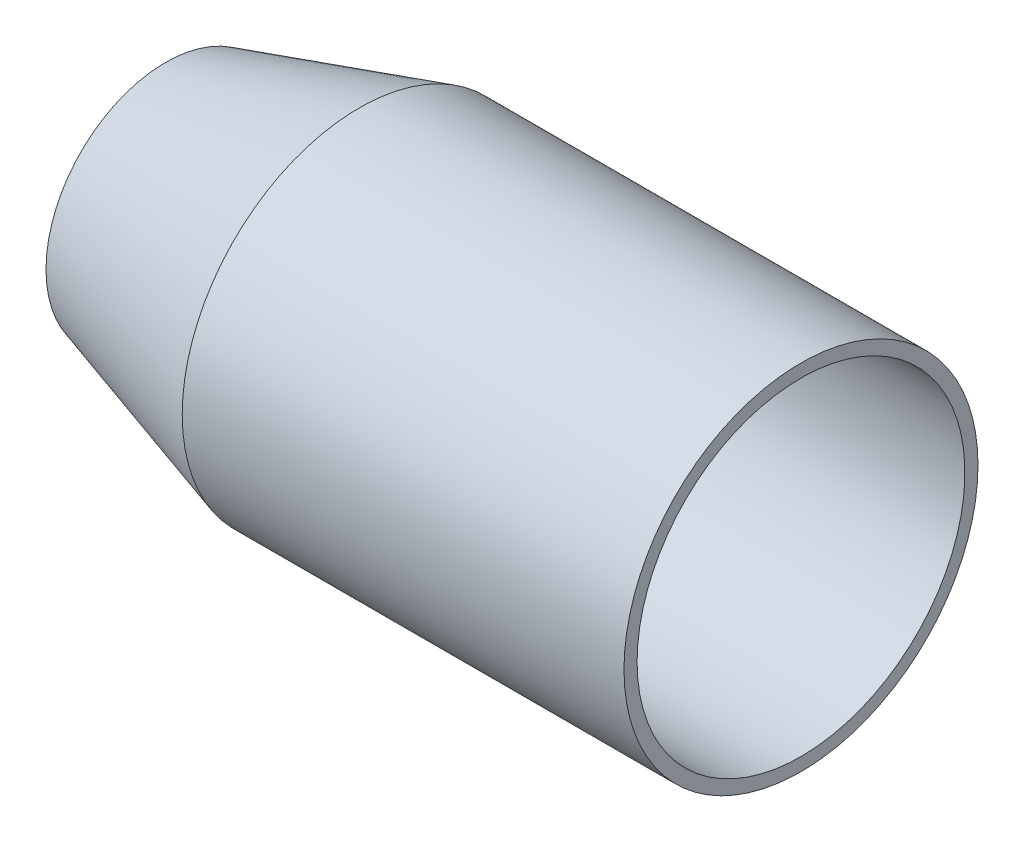
ISO-10303-21;
HEADER;
FILE_DESCRIPTION(('STEP AP214'),'2;1');
FILE_NAME('part.step','',(''),(''),'','','');
FILE_SCHEMA(('AUTOMOTIVE_DESIGN { 1 0 10303 214 1 1 1 1 }'));
ENDSEC;
DATA;
#1=APPLICATION_CONTEXT('core data for automotive mechanical design processes');
#2=APPLICATION_PROTOCOL_DEFINITION('international standard','automotive_design',2000,#1);
#3=PRODUCT_CONTEXT('',#1,'mechanical');
#4=PRODUCT('Part','Part','',(#3));
#5=PRODUCT_RELATED_PRODUCT_CATEGORY('part','',(#4));
#6=PRODUCT_DEFINITION_FORMATION('','',#4);
#7=PRODUCT_DEFINITION_CONTEXT('part definition',#1,'design');
#8=PRODUCT_DEFINITION('design','',#6,#7);
#9=PRODUCT_DEFINITION_SHAPE('','',#8);
#10=(LENGTH_UNIT() NAMED_UNIT(*) SI_UNIT(.MILLI.,.METRE.));
#11=(NAMED_UNIT(*) PLANE_ANGLE_UNIT() SI_UNIT($,.RADIAN.));
#12=(NAMED_UNIT(*) SI_UNIT($,.STERADIAN.) SOLID_ANGLE_UNIT());
#13=UNCERTAINTY_MEASURE_WITH_UNIT(LENGTH_MEASURE(1.E-05),#10,'distance_accuracy_value','');
#14=(GEOMETRIC_REPRESENTATION_CONTEXT(3) GLOBAL_UNCERTAINTY_ASSIGNED_CONTEXT((#13)) GLOBAL_UNIT_ASSIGNED_CONTEXT((#10,
#11,#12)) REPRESENTATION_CONTEXT('',''));
#15=CARTESIAN_POINT('',(0.,0.,0.));
#16=DIRECTION('',(0.,0.,1.));
#17=DIRECTION('',(1.,0.,0.));
#18=AXIS2_PLACEMENT_3D('',#15,#16,#17);
#19=CARTESIAN_POINT('',(0.,0.,0.));
#20=DIRECTION('',(-1.,0.,0.));
#21=DIRECTION('',(0.,0.,1.));
#22=AXIS2_PLACEMENT_3D('',#19,#20,#21);
#23=CYLINDRICAL_SURFACE('',#22,74.295);
#24=CARTESIAN_POINT('',(266.7,0.,0.));
#25=DIRECTION('',(-1.,0.,0.));
#26=DIRECTION('',(0.,0.,1.));
#27=AXIS2_PLACEMENT_3D('',#24,#25,#26);
#28=CIRCLE('',#27,74.295);
#29=CARTESIAN_POINT('',(266.7,0.,74.295));
#30=VERTEX_POINT('',#29);
#31=EDGE_CURVE('E66',#30,#30,#28,.T.);
#32=ORIENTED_EDGE('',*,*,#31,.T.);
#33=EDGE_LOOP('',(#32));
#34=FACE_BOUND('',#33,.T.);
#35=CARTESIAN_POINT('',(81.28,0.,0.));
#36=DIRECTION('',(-1.,0.,0.));
#37=DIRECTION('',(0.,0.,1.));
#38=AXIS2_PLACEMENT_3D('',#35,#36,#37);
#39=CIRCLE('',#38,74.295);
#40=CARTESIAN_POINT('',(81.28,0.,74.295));
#41=VERTEX_POINT('',#40);
#42=EDGE_CURVE('E10',#41,#41,#39,.T.);
#43=ORIENTED_EDGE('',*,*,#42,.F.);
#44=EDGE_LOOP('',(#43));
#45=FACE_BOUND('',#44,.T.);
#46=ADVANCED_FACE('F39',(#34,#45),#23,.T.);
#47=CARTESIAN_POINT('',(81.28,0.,0.));
#48=DIRECTION('',(1.,0.,0.));
#49=DIRECTION('',(0.,0.,-1.));
#50=AXIS2_PLACEMENT_3D('',#47,#48,#49);
#51=CONICAL_SURFACE('',#50,74.295,0.288340484549115);
#52=CARTESIAN_POINT('',(0.,0.,0.));
#53=DIRECTION('',(-1.,0.,0.));
#54=DIRECTION('',(0.,0.,1.));
#55=AXIS2_PLACEMENT_3D('',#52,#53,#54);
#56=CIRCLE('',#55,50.1868331198608);
#57=CARTESIAN_POINT('',(0.,0.,50.1868331198608));
#58=VERTEX_POINT('',#57);
#59=EDGE_CURVE('E46',#58,#58,#56,.T.);
#60=ORIENTED_EDGE('',*,*,#59,.F.);
#61=EDGE_LOOP('',(#60));
#62=FACE_BOUND('',#61,.T.);
#63=ORIENTED_EDGE('',*,*,#42,.T.);
#64=EDGE_LOOP('',(#63));
#65=FACE_BOUND('',#64,.T.);
#66=ADVANCED_FACE('F91',(#62,#65),#51,.T.);
#67=CARTESIAN_POINT('',(0.,0.,0.));
#68=DIRECTION('',(1.,0.,0.));
#69=DIRECTION('',(0.,0.,-1.));
#70=AXIS2_PLACEMENT_3D('',#67,#68,#69);
#71=PLANE('',#70);
#72=CARTESIAN_POINT('',(0.,0.,0.));
#73=DIRECTION('',(-1.,0.,0.));
#74=DIRECTION('',(0.,0.,1.));
#75=AXIS2_PLACEMENT_3D('',#72,#73,#74);
#76=CIRCLE('',#75,44.45);
#77=CARTESIAN_POINT('',(0.,0.,44.45));
#78=VERTEX_POINT('',#77);
#79=EDGE_CURVE('E51',#78,#78,#76,.T.);
#80=ORIENTED_EDGE('',*,*,#79,.F.);
#81=EDGE_LOOP('',(#80));
#82=FACE_BOUND('',#81,.T.);
#83=ORIENTED_EDGE('',*,*,#59,.T.);
#84=EDGE_LOOP('',(#83));
#85=FACE_BOUND('',#84,.T.);
#86=ADVANCED_FACE('F87',(#82,#85),#71,.F.);
#87=CARTESIAN_POINT('',(82.0784761378992,0.,0.));
#88=DIRECTION('',(1.,0.,0.));
#89=DIRECTION('',(0.,0.,-1.));
#90=AXIS2_PLACEMENT_3D('',#87,#88,#89);
#91=CONICAL_SURFACE('',#90,68.795,0.288340484549115);
#92=ORIENTED_EDGE('',*,*,#79,.T.);
#93=EDGE_LOOP('',(#92));
#94=FACE_BOUND('',#93,.T.);
#95=CARTESIAN_POINT('',(82.0784761378992,0.,0.));
#96=DIRECTION('',(-1.,0.,0.));
#97=DIRECTION('',(0.,0.,1.));
#98=AXIS2_PLACEMENT_3D('',#95,#96,#97);
#99=CIRCLE('',#98,68.795);
#100=CARTESIAN_POINT('',(82.0784761378992,0.,68.795));
#101=VERTEX_POINT('',#100);
#102=EDGE_CURVE('E56',#101,#101,#99,.T.);
#103=ORIENTED_EDGE('',*,*,#102,.F.);
#104=EDGE_LOOP('',(#103));
#105=FACE_BOUND('',#104,.T.);
#106=ADVANCED_FACE('F81',(#94,#105),#91,.F.);
#107=CARTESIAN_POINT('',(0.,0.,0.));
#108=DIRECTION('',(-1.,0.,0.));
#109=DIRECTION('',(0.,0.,1.));
#110=AXIS2_PLACEMENT_3D('',#107,#108,#109);
#111=CYLINDRICAL_SURFACE('',#110,68.795);
#112=ORIENTED_EDGE('',*,*,#102,.T.);
#113=EDGE_LOOP('',(#112));
#114=FACE_BOUND('',#113,.T.);
#115=CARTESIAN_POINT('',(266.7,0.,0.));
#116=DIRECTION('',(-1.,0.,0.));
#117=DIRECTION('',(0.,0.,1.));
#118=AXIS2_PLACEMENT_3D('',#115,#116,#117);
#119=CIRCLE('',#118,68.795);
#120=CARTESIAN_POINT('',(266.7,0.,68.795));
#121=VERTEX_POINT('',#120);
#122=EDGE_CURVE('E62',#121,#121,#119,.T.);
#123=ORIENTED_EDGE('',*,*,#122,.F.);
#124=EDGE_LOOP('',(#123));
#125=FACE_BOUND('',#124,.T.);
#126=ADVANCED_FACE('F76',(#114,#125),#111,.F.);
#127=CARTESIAN_POINT('',(266.7,2.141746695606E-13,0.));
#128=DIRECTION('',(-1.,0.,0.));
#129=DIRECTION('',(0.,0.,1.));
#130=AXIS2_PLACEMENT_3D('',#127,#128,#129);
#131=PLANE('',#130);
#132=ORIENTED_EDGE('',*,*,#31,.F.);
#133=EDGE_LOOP('',(#132));
#134=FACE_BOUND('',#133,.T.);
#135=ORIENTED_EDGE('',*,*,#122,.T.);
#136=EDGE_LOOP('',(#135));
#137=FACE_BOUND('',#136,.T.);
#138=ADVANCED_FACE('F73',(#134,#137),#131,.F.);
#139=CLOSED_SHELL('',(#46,#66,#86,#106,#126,#138));
#140=MANIFOLD_SOLID_BREP('B2',#139);
#141=ADVANCED_BREP_SHAPE_REPRESENTATION('',(#18,#140),#14);
#142=SHAPE_DEFINITION_REPRESENTATION(#9,#141);
ENDSEC;
END-ISO-10303-21;
